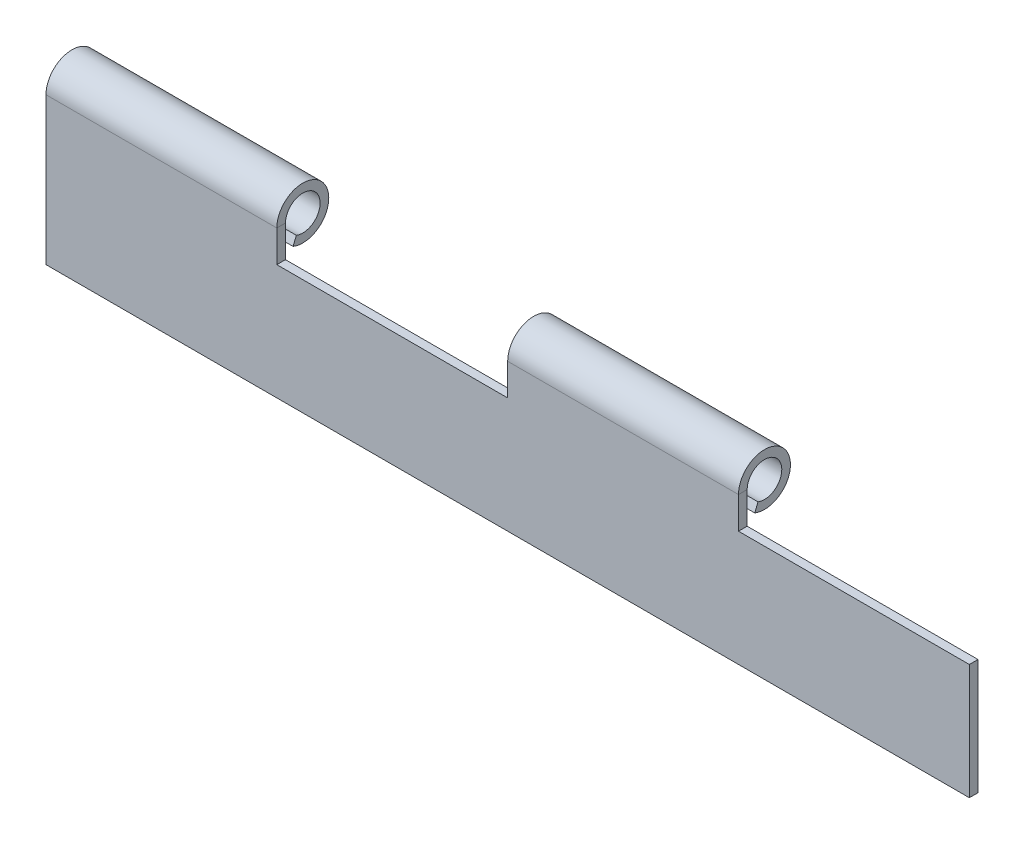
ISO-10303-21;
HEADER;
FILE_DESCRIPTION(('STEP AP214'),'2;1');
FILE_NAME('part.step','',(''),(''),'','','');
FILE_SCHEMA(('AUTOMOTIVE_DESIGN { 1 0 10303 214 1 1 1 1 }'));
ENDSEC;
DATA;
#1=APPLICATION_CONTEXT('core data for automotive mechanical design processes');
#2=APPLICATION_PROTOCOL_DEFINITION('international standard','automotive_design',2000,#1);
#3=PRODUCT_CONTEXT('',#1,'mechanical');
#4=PRODUCT('Part','Part','',(#3));
#5=PRODUCT_RELATED_PRODUCT_CATEGORY('part','',(#4));
#6=PRODUCT_DEFINITION_FORMATION('','',#4);
#7=PRODUCT_DEFINITION_CONTEXT('part definition',#1,'design');
#8=PRODUCT_DEFINITION('design','',#6,#7);
#9=PRODUCT_DEFINITION_SHAPE('','',#8);
#10=(LENGTH_UNIT() NAMED_UNIT(*) SI_UNIT(.MILLI.,.METRE.));
#11=(NAMED_UNIT(*) PLANE_ANGLE_UNIT() SI_UNIT($,.RADIAN.));
#12=(NAMED_UNIT(*) SI_UNIT($,.STERADIAN.) SOLID_ANGLE_UNIT());
#13=UNCERTAINTY_MEASURE_WITH_UNIT(LENGTH_MEASURE(1.E-05),#10,'distance_accuracy_value','');
#14=(GEOMETRIC_REPRESENTATION_CONTEXT(3) GLOBAL_UNCERTAINTY_ASSIGNED_CONTEXT((#13)) GLOBAL_UNIT_ASSIGNED_CONTEXT((#10,
#11,#12)) REPRESENTATION_CONTEXT('',''));
#15=CARTESIAN_POINT('',(0.,0.,0.));
#16=DIRECTION('',(0.,0.,1.));
#17=DIRECTION('',(1.,0.,0.));
#18=AXIS2_PLACEMENT_3D('',#15,#16,#17);
#19=CARTESIAN_POINT('',(80.,20.,1.5));
#20=DIRECTION('',(-1.,0.,0.));
#21=DIRECTION('',(0.,0.,-1.));
#22=AXIS2_PLACEMENT_3D('',#19,#20,#21);
#23=PLANE('',#22);
#24=DIRECTION('',(0.,-1.,0.));
#25=VECTOR('',#24,1.);
#26=CARTESIAN_POINT('',(80.,20.,0.));
#27=LINE('',#26,#25);
#28=CARTESIAN_POINT('',(80.,25.5,0.));
#29=VERTEX_POINT('',#28);
#30=CARTESIAN_POINT('',(80.,20.,0.));
#31=VERTEX_POINT('',#30);
#32=EDGE_CURVE('E246',#29,#31,#27,.T.);
#33=ORIENTED_EDGE('',*,*,#32,.T.);
#34=DIRECTION('',(0.,0.,-1.));
#35=VECTOR('',#34,1.);
#36=CARTESIAN_POINT('',(80.,20.,1.5));
#37=LINE('',#36,#35);
#38=CARTESIAN_POINT('',(80.,20.,1.5));
#39=VERTEX_POINT('',#38);
#40=EDGE_CURVE('E258',#39,#31,#37,.T.);
#41=ORIENTED_EDGE('',*,*,#40,.F.);
#42=DIRECTION('',(0.,-1.,0.));
#43=VECTOR('',#42,1.);
#44=CARTESIAN_POINT('',(80.,20.,1.5));
#45=LINE('',#44,#43);
#46=CARTESIAN_POINT('',(80.,25.5,1.5));
#47=VERTEX_POINT('',#46);
#48=EDGE_CURVE('E176',#47,#39,#45,.T.);
#49=ORIENTED_EDGE('',*,*,#48,.F.);
#50=DIRECTION('',(0.,0.,1.));
#51=VECTOR('',#50,1.);
#52=CARTESIAN_POINT('',(80.,25.5,0.));
#53=LINE('',#52,#51);
#54=EDGE_CURVE('E158',#29,#47,#53,.T.);
#55=ORIENTED_EDGE('',*,*,#54,.F.);
#56=EDGE_LOOP('',(#33,#41,#49,#55));
#57=FACE_BOUND('',#56,.T.);
#58=ADVANCED_FACE('F43',(#57),#23,.T.);
#59=CARTESIAN_POINT('',(0.,0.,1.5));
#60=DIRECTION('',(-1.,0.,0.));
#61=DIRECTION('',(0.,0.,-1.));
#62=AXIS2_PLACEMENT_3D('',#59,#60,#61);
#63=PLANE('',#62);
#64=DIRECTION('',(0.,-1.,0.));
#65=VECTOR('',#64,1.);
#66=CARTESIAN_POINT('',(0.,0.,0.));
#67=LINE('',#66,#65);
#68=CARTESIAN_POINT('',(0.,25.5,0.));
#69=VERTEX_POINT('',#68);
#70=CARTESIAN_POINT('',(0.,0.,0.));
#71=VERTEX_POINT('',#70);
#72=EDGE_CURVE('E227',#69,#71,#67,.T.);
#73=ORIENTED_EDGE('',*,*,#72,.T.);
#74=DIRECTION('',(0.,0.,-1.));
#75=VECTOR('',#74,1.);
#76=CARTESIAN_POINT('',(0.,0.,1.5));
#77=LINE('',#76,#75);
#78=CARTESIAN_POINT('',(0.,0.,1.5));
#79=VERTEX_POINT('',#78);
#80=EDGE_CURVE('E11',#79,#71,#77,.T.);
#81=ORIENTED_EDGE('',*,*,#80,.F.);
#82=DIRECTION('',(0.,-1.,0.));
#83=VECTOR('',#82,1.);
#84=CARTESIAN_POINT('',(0.,0.,1.5));
#85=LINE('',#84,#83);
#86=CARTESIAN_POINT('',(0.,25.5,1.5));
#87=VERTEX_POINT('',#86);
#88=EDGE_CURVE('E236',#87,#79,#85,.T.);
#89=ORIENTED_EDGE('',*,*,#88,.F.);
#90=DIRECTION('',(0.,0.,1.));
#91=VECTOR('',#90,1.);
#92=CARTESIAN_POINT('',(0.,25.5,0.));
#93=LINE('',#92,#91);
#94=EDGE_CURVE('E199',#69,#87,#93,.T.);
#95=ORIENTED_EDGE('',*,*,#94,.F.);
#96=EDGE_LOOP('',(#73,#81,#89,#95));
#97=FACE_BOUND('',#96,.T.);
#98=ADVANCED_FACE('F287',(#97),#63,.T.);
#99=CARTESIAN_POINT('',(160.,0.,1.5));
#100=DIRECTION('',(0.,-1.,0.));
#101=DIRECTION('',(1.,0.,0.));
#102=AXIS2_PLACEMENT_3D('',#99,#100,#101);
#103=PLANE('',#102);
#104=DIRECTION('',(1.,0.,0.));
#105=VECTOR('',#104,1.);
#106=CARTESIAN_POINT('',(160.,0.,0.));
#107=LINE('',#106,#105);
#108=CARTESIAN_POINT('',(160.,0.,0.));
#109=VERTEX_POINT('',#108);
#110=EDGE_CURVE('E221',#71,#109,#107,.T.);
#111=ORIENTED_EDGE('',*,*,#110,.T.);
#112=DIRECTION('',(0.,0.,-1.));
#113=VECTOR('',#112,1.);
#114=CARTESIAN_POINT('',(160.,0.,1.5));
#115=LINE('',#114,#113);
#116=CARTESIAN_POINT('',(160.,0.,1.5));
#117=VERTEX_POINT('',#116);
#118=EDGE_CURVE('E47',#117,#109,#115,.T.);
#119=ORIENTED_EDGE('',*,*,#118,.F.);
#120=DIRECTION('',(1.,0.,0.));
#121=VECTOR('',#120,1.);
#122=CARTESIAN_POINT('',(160.,0.,1.5));
#123=LINE('',#122,#121);
#124=EDGE_CURVE('E223',#79,#117,#123,.T.);
#125=ORIENTED_EDGE('',*,*,#124,.F.);
#126=ORIENTED_EDGE('',*,*,#80,.T.);
#127=EDGE_LOOP('',(#111,#119,#125,#126));
#128=FACE_BOUND('',#127,.T.);
#129=ADVANCED_FACE('F45',(#128),#103,.T.);
#130=CARTESIAN_POINT('',(40.,30.,1.5));
#131=DIRECTION('',(1.,0.,0.));
#132=DIRECTION('',(0.,0.,1.));
#133=AXIS2_PLACEMENT_3D('',#130,#131,#132);
#134=PLANE('',#133);
#135=DIRECTION('',(0.,0.,1.));
#136=VECTOR('',#135,1.);
#137=CARTESIAN_POINT('',(40.,25.5,0.));
#138=LINE('',#137,#136);
#139=CARTESIAN_POINT('',(40.,25.5,0.));
#140=VERTEX_POINT('',#139);
#141=CARTESIAN_POINT('',(40.,25.5,1.5));
#142=VERTEX_POINT('',#141);
#143=EDGE_CURVE('E212',#140,#142,#138,.T.);
#144=ORIENTED_EDGE('',*,*,#143,.T.);
#145=DIRECTION('',(0.,1.,0.));
#146=VECTOR('',#145,1.);
#147=CARTESIAN_POINT('',(40.,30.,1.5));
#148=LINE('',#147,#146);
#149=CARTESIAN_POINT('',(40.,20.,1.5));
#150=VERTEX_POINT('',#149);
#151=EDGE_CURVE('E233',#150,#142,#148,.T.);
#152=ORIENTED_EDGE('',*,*,#151,.F.);
#153=DIRECTION('',(0.,0.,-1.));
#154=VECTOR('',#153,1.);
#155=CARTESIAN_POINT('',(40.,20.,1.5));
#156=LINE('',#155,#154);
#157=CARTESIAN_POINT('',(40.,20.,0.));
#158=VERTEX_POINT('',#157);
#159=EDGE_CURVE('E52',#150,#158,#156,.T.);
#160=ORIENTED_EDGE('',*,*,#159,.T.);
#161=DIRECTION('',(0.,1.,0.));
#162=VECTOR('',#161,1.);
#163=CARTESIAN_POINT('',(40.,30.,0.));
#164=LINE('',#163,#162);
#165=EDGE_CURVE('E251',#158,#140,#164,.T.);
#166=ORIENTED_EDGE('',*,*,#165,.T.);
#167=EDGE_LOOP('',(#144,#152,#160,#166));
#168=FACE_BOUND('',#167,.T.);
#169=ADVANCED_FACE('F298',(#168),#134,.T.);
#170=CARTESIAN_POINT('',(40.,20.,1.5));
#171=DIRECTION('',(0.,1.,0.));
#172=DIRECTION('',(-1.,0.,0.));
#173=AXIS2_PLACEMENT_3D('',#170,#171,#172);
#174=PLANE('',#173);
#175=DIRECTION('',(-1.,0.,0.));
#176=VECTOR('',#175,1.);
#177=CARTESIAN_POINT('',(40.,20.,0.));
#178=LINE('',#177,#176);
#179=EDGE_CURVE('E249',#31,#158,#178,.T.);
#180=ORIENTED_EDGE('',*,*,#179,.T.);
#181=ORIENTED_EDGE('',*,*,#159,.F.);
#182=DIRECTION('',(-1.,0.,0.));
#183=VECTOR('',#182,1.);
#184=CARTESIAN_POINT('',(40.,20.,1.5));
#185=LINE('',#184,#183);
#186=EDGE_CURVE('E231',#39,#150,#185,.T.);
#187=ORIENTED_EDGE('',*,*,#186,.F.);
#188=ORIENTED_EDGE('',*,*,#40,.T.);
#189=EDGE_LOOP('',(#180,#181,#187,#188));
#190=FACE_BOUND('',#189,.T.);
#191=ADVANCED_FACE('F284',(#190),#174,.T.);
#192=CARTESIAN_POINT('',(120.,30.,1.5));
#193=DIRECTION('',(1.,0.,0.));
#194=DIRECTION('',(0.,0.,1.));
#195=AXIS2_PLACEMENT_3D('',#192,#193,#194);
#196=PLANE('',#195);
#197=DIRECTION('',(0.,0.,1.));
#198=VECTOR('',#197,1.);
#199=CARTESIAN_POINT('',(120.,25.5,0.));
#200=LINE('',#199,#198);
#201=CARTESIAN_POINT('',(120.,25.5,0.));
#202=VERTEX_POINT('',#201);
#203=CARTESIAN_POINT('',(120.,25.5,1.5));
#204=VERTEX_POINT('',#203);
#205=EDGE_CURVE('E152',#202,#204,#200,.T.);
#206=ORIENTED_EDGE('',*,*,#205,.T.);
#207=DIRECTION('',(0.,1.,0.));
#208=VECTOR('',#207,1.);
#209=CARTESIAN_POINT('',(120.,30.,1.5));
#210=LINE('',#209,#208);
#211=CARTESIAN_POINT('',(120.,20.,1.5));
#212=VERTEX_POINT('',#211);
#213=EDGE_CURVE('E169',#212,#204,#210,.T.);
#214=ORIENTED_EDGE('',*,*,#213,.F.);
#215=DIRECTION('',(0.,0.,-1.));
#216=VECTOR('',#215,1.);
#217=CARTESIAN_POINT('',(120.,20.,1.5));
#218=LINE('',#217,#216);
#219=CARTESIAN_POINT('',(120.,20.,0.));
#220=VERTEX_POINT('',#219);
#221=EDGE_CURVE('E261',#212,#220,#218,.T.);
#222=ORIENTED_EDGE('',*,*,#221,.T.);
#223=DIRECTION('',(0.,1.,0.));
#224=VECTOR('',#223,1.);
#225=CARTESIAN_POINT('',(120.,30.,0.));
#226=LINE('',#225,#224);
#227=EDGE_CURVE('E181',#220,#202,#226,.T.);
#228=ORIENTED_EDGE('',*,*,#227,.T.);
#229=EDGE_LOOP('',(#206,#214,#222,#228));
#230=FACE_BOUND('',#229,.T.);
#231=ADVANCED_FACE('F179',(#230),#196,.T.);
#232=CARTESIAN_POINT('',(120.,20.,1.5));
#233=DIRECTION('',(0.,1.,0.));
#234=DIRECTION('',(0.,0.,-1.));
#235=AXIS2_PLACEMENT_3D('',#232,#233,#234);
#236=PLANE('',#235);
#237=DIRECTION('',(-1.,0.,0.));
#238=VECTOR('',#237,1.);
#239=CARTESIAN_POINT('',(120.,20.,0.));
#240=LINE('',#239,#238);
#241=CARTESIAN_POINT('',(160.,20.,0.));
#242=VERTEX_POINT('',#241);
#243=EDGE_CURVE('E243',#242,#220,#240,.T.);
#244=ORIENTED_EDGE('',*,*,#243,.T.);
#245=ORIENTED_EDGE('',*,*,#221,.F.);
#246=DIRECTION('',(-1.,0.,0.));
#247=VECTOR('',#246,1.);
#248=CARTESIAN_POINT('',(120.,20.,1.5));
#249=LINE('',#248,#247);
#250=CARTESIAN_POINT('',(160.,20.,1.5));
#251=VERTEX_POINT('',#250);
#252=EDGE_CURVE('E172',#251,#212,#249,.T.);
#253=ORIENTED_EDGE('',*,*,#252,.F.);
#254=DIRECTION('',(0.,0.,-1.));
#255=VECTOR('',#254,1.);
#256=CARTESIAN_POINT('',(160.,20.,1.5));
#257=LINE('',#256,#255);
#258=EDGE_CURVE('E262',#251,#242,#257,.T.);
#259=ORIENTED_EDGE('',*,*,#258,.T.);
#260=EDGE_LOOP('',(#244,#245,#253,#259));
#261=FACE_BOUND('',#260,.T.);
#262=ADVANCED_FACE('F277',(#261),#236,.T.);
#263=CARTESIAN_POINT('',(160.,20.,1.5));
#264=DIRECTION('',(1.,0.,0.));
#265=DIRECTION('',(0.,0.,1.));
#266=AXIS2_PLACEMENT_3D('',#263,#264,#265);
#267=PLANE('',#266);
#268=DIRECTION('',(0.,1.,0.));
#269=VECTOR('',#268,1.);
#270=CARTESIAN_POINT('',(160.,20.,0.));
#271=LINE('',#270,#269);
#272=EDGE_CURVE('E241',#109,#242,#271,.T.);
#273=ORIENTED_EDGE('',*,*,#272,.T.);
#274=ORIENTED_EDGE('',*,*,#258,.F.);
#275=DIRECTION('',(0.,1.,0.));
#276=VECTOR('',#275,1.);
#277=CARTESIAN_POINT('',(160.,20.,1.5));
#278=LINE('',#277,#276);
#279=EDGE_CURVE('E226',#117,#251,#278,.T.);
#280=ORIENTED_EDGE('',*,*,#279,.F.);
#281=ORIENTED_EDGE('',*,*,#118,.T.);
#282=EDGE_LOOP('',(#273,#274,#280,#281));
#283=FACE_BOUND('',#282,.T.);
#284=ADVANCED_FACE('F270',(#283),#267,.T.);
#285=CARTESIAN_POINT('',(0.,0.,1.5));
#286=DIRECTION('',(0.,0.,1.));
#287=DIRECTION('',(-1.,0.,0.));
#288=AXIS2_PLACEMENT_3D('',#285,#286,#287);
#289=PLANE('',#288);
#290=DIRECTION('',(-1.,0.,0.));
#291=VECTOR('',#290,1.);
#292=CARTESIAN_POINT('',(80.,25.5,1.5));
#293=LINE('',#292,#291);
#294=EDGE_CURVE('E159',#47,#204,#293,.F.);
#295=ORIENTED_EDGE('',*,*,#294,.F.);
#296=ORIENTED_EDGE('',*,*,#48,.T.);
#297=ORIENTED_EDGE('',*,*,#186,.T.);
#298=ORIENTED_EDGE('',*,*,#151,.T.);
#299=DIRECTION('',(-1.,0.,0.));
#300=VECTOR('',#299,1.);
#301=CARTESIAN_POINT('',(0.,25.5,1.5));
#302=LINE('',#301,#300);
#303=EDGE_CURVE('E193',#87,#142,#302,.F.);
#304=ORIENTED_EDGE('',*,*,#303,.F.);
#305=ORIENTED_EDGE('',*,*,#88,.T.);
#306=ORIENTED_EDGE('',*,*,#124,.T.);
#307=ORIENTED_EDGE('',*,*,#279,.T.);
#308=ORIENTED_EDGE('',*,*,#252,.T.);
#309=ORIENTED_EDGE('',*,*,#213,.T.);
#310=EDGE_LOOP('',(#295,#296,#297,#298,#304,#305,#306,#307,#308,#309));
#311=FACE_BOUND('',#310,.T.);
#312=ADVANCED_FACE('F170',(#311),#289,.T.);
#313=CARTESIAN_POINT('',(0.,0.,0.));
#314=DIRECTION('',(0.,0.,1.));
#315=DIRECTION('',(-1.,0.,0.));
#316=AXIS2_PLACEMENT_3D('',#313,#314,#315);
#317=PLANE('',#316);
#318=ORIENTED_EDGE('',*,*,#227,.F.);
#319=ORIENTED_EDGE('',*,*,#243,.F.);
#320=ORIENTED_EDGE('',*,*,#272,.F.);
#321=ORIENTED_EDGE('',*,*,#110,.F.);
#322=ORIENTED_EDGE('',*,*,#72,.F.);
#323=DIRECTION('',(-1.,0.,0.));
#324=VECTOR('',#323,1.);
#325=CARTESIAN_POINT('',(0.,25.5,0.));
#326=LINE('',#325,#324);
#327=EDGE_CURVE('E206',#69,#140,#326,.F.);
#328=ORIENTED_EDGE('',*,*,#327,.T.);
#329=ORIENTED_EDGE('',*,*,#165,.F.);
#330=ORIENTED_EDGE('',*,*,#179,.F.);
#331=ORIENTED_EDGE('',*,*,#32,.F.);
#332=DIRECTION('',(-1.,0.,0.));
#333=VECTOR('',#332,1.);
#334=CARTESIAN_POINT('',(80.,25.5,0.));
#335=LINE('',#334,#333);
#336=EDGE_CURVE('E497',#29,#202,#335,.F.);
#337=ORIENTED_EDGE('',*,*,#336,.T.);
#338=EDGE_LOOP('',(#318,#319,#320,#321,#322,#328,#329,#330,#331,#337));
#339=FACE_BOUND('',#338,.T.);
#340=ADVANCED_FACE('F275',(#339),#317,.F.);
#341=CARTESIAN_POINT('',(20.,22.7184484362996,-1.87618021975223));
#342=DIRECTION('',(0.,-0.374606593415923,-0.927183854566783));
#343=DIRECTION('',(-1.,0.,0.));
#344=AXIS2_PLACEMENT_3D('',#341,#342,#343);
#345=PLANE('',#344);
#346=DIRECTION('',(0.,-0.927183854566783,0.374606593415923));
#347=VECTOR('',#346,1.);
#348=CARTESIAN_POINT('',(0.,22.7184484362996,-1.87618021975223));
#349=LINE('',#348,#347);
#350=CARTESIAN_POINT('',(0.,22.7184484362996,-1.87618021975223));
#351=VERTEX_POINT('',#350);
#352=CARTESIAN_POINT('',(0.,21.3276726544495,-1.31427032962835));
#353=VERTEX_POINT('',#352);
#354=EDGE_CURVE('E218',#351,#353,#349,.T.);
#355=ORIENTED_EDGE('',*,*,#354,.T.);
#356=DIRECTION('',(-1.,0.,0.));
#357=VECTOR('',#356,1.);
#358=CARTESIAN_POINT('',(0.,21.3276726544495,-1.31427032962835));
#359=LINE('',#358,#357);
#360=CARTESIAN_POINT('',(40.,21.3276726544495,-1.31427032962835));
#361=VERTEX_POINT('',#360);
#362=EDGE_CURVE('E200',#361,#353,#359,.T.);
#363=ORIENTED_EDGE('',*,*,#362,.F.);
#364=DIRECTION('',(0.,-0.927183854566783,0.374606593415923));
#365=VECTOR('',#364,1.);
#366=CARTESIAN_POINT('',(40.,22.7184484362996,-1.87618021975223));
#367=LINE('',#366,#365);
#368=CARTESIAN_POINT('',(40.,22.7184484362996,-1.87618021975223));
#369=VERTEX_POINT('',#368);
#370=EDGE_CURVE('E215',#369,#361,#367,.T.);
#371=ORIENTED_EDGE('',*,*,#370,.F.);
#372=DIRECTION('',(-1.,0.,0.));
#373=VECTOR('',#372,1.);
#374=CARTESIAN_POINT('',(0.,22.7184484362996,-1.87618021975223));
#375=LINE('',#374,#373);
#376=EDGE_CURVE('E191',#369,#351,#375,.T.);
#377=ORIENTED_EDGE('',*,*,#376,.T.);
#378=EDGE_LOOP('',(#355,#363,#371,#377));
#379=FACE_BOUND('',#378,.T.);
#380=ADVANCED_FACE('F305',(#379),#345,.F.);
#381=CARTESIAN_POINT('',(40.,25.5,-3.));
#382=DIRECTION('',(1.,0.,0.));
#383=DIRECTION('',(0.,0.,1.));
#384=AXIS2_PLACEMENT_3D('',#381,#382,#383);
#385=PLANE('',#384);
#386=ORIENTED_EDGE('',*,*,#370,.T.);
#387=CARTESIAN_POINT('',(40.,25.5,-3.));
#388=DIRECTION('',(1.,0.,0.));
#389=DIRECTION('',(0.,0.,-1.));
#390=AXIS2_PLACEMENT_3D('',#387,#388,#389);
#391=CIRCLE('',#390,4.5);
#392=EDGE_CURVE('E196',#142,#361,#391,.F.);
#393=ORIENTED_EDGE('',*,*,#392,.F.);
#394=ORIENTED_EDGE('',*,*,#143,.F.);
#395=CARTESIAN_POINT('',(40.,25.5,-3.));
#396=DIRECTION('',(1.,0.,0.));
#397=DIRECTION('',(0.,0.,-1.));
#398=AXIS2_PLACEMENT_3D('',#395,#396,#397);
#399=CIRCLE('',#398,3.);
#400=EDGE_CURVE('E203',#140,#369,#399,.F.);
#401=ORIENTED_EDGE('',*,*,#400,.T.);
#402=EDGE_LOOP('',(#386,#393,#394,#401));
#403=FACE_BOUND('',#402,.T.);
#404=ADVANCED_FACE('F312',(#403),#385,.T.);
#405=CARTESIAN_POINT('',(0.,25.5,-3.));
#406=DIRECTION('',(1.,0.,0.));
#407=DIRECTION('',(0.,0.,1.));
#408=AXIS2_PLACEMENT_3D('',#405,#406,#407);
#409=PLANE('',#408);
#410=CARTESIAN_POINT('',(0.,25.5,-3.));
#411=DIRECTION('',(1.,0.,0.));
#412=DIRECTION('',(0.,0.,-1.));
#413=AXIS2_PLACEMENT_3D('',#410,#411,#412);
#414=CIRCLE('',#413,3.);
#415=EDGE_CURVE('E68',#351,#69,#414,.T.);
#416=ORIENTED_EDGE('',*,*,#415,.T.);
#417=ORIENTED_EDGE('',*,*,#94,.T.);
#418=CARTESIAN_POINT('',(0.,25.5,-3.));
#419=DIRECTION('',(1.,0.,0.));
#420=DIRECTION('',(0.,0.,-1.));
#421=AXIS2_PLACEMENT_3D('',#418,#419,#420);
#422=CIRCLE('',#421,4.5);
#423=EDGE_CURVE('E197',#353,#87,#422,.T.);
#424=ORIENTED_EDGE('',*,*,#423,.F.);
#425=ORIENTED_EDGE('',*,*,#354,.F.);
#426=EDGE_LOOP('',(#416,#417,#424,#425));
#427=FACE_BOUND('',#426,.T.);
#428=ADVANCED_FACE('F308',(#427),#409,.F.);
#429=CARTESIAN_POINT('',(0.,25.5,-3.));
#430=DIRECTION('',(-1.,0.,0.));
#431=DIRECTION('',(0.,-0.927183854566783,0.374606593415923));
#432=AXIS2_PLACEMENT_3D('',#429,#430,#431);
#433=CYLINDRICAL_SURFACE('',#432,4.5);
#434=ORIENTED_EDGE('',*,*,#303,.T.);
#435=ORIENTED_EDGE('',*,*,#392,.T.);
#436=ORIENTED_EDGE('',*,*,#362,.T.);
#437=ORIENTED_EDGE('',*,*,#423,.T.);
#438=EDGE_LOOP('',(#434,#435,#436,#437));
#439=FACE_BOUND('',#438,.T.);
#440=ADVANCED_FACE('F311',(#439),#433,.T.);
#441=CARTESIAN_POINT('',(0.,25.5,-3.));
#442=DIRECTION('',(-1.,0.,0.));
#443=DIRECTION('',(0.,-0.927183854566783,0.374606593415923));
#444=AXIS2_PLACEMENT_3D('',#441,#442,#443);
#445=CYLINDRICAL_SURFACE('',#444,3.);
#446=ORIENTED_EDGE('',*,*,#327,.F.);
#447=ORIENTED_EDGE('',*,*,#415,.F.);
#448=ORIENTED_EDGE('',*,*,#376,.F.);
#449=ORIENTED_EDGE('',*,*,#400,.F.);
#450=EDGE_LOOP('',(#446,#447,#448,#449));
#451=FACE_BOUND('',#450,.T.);
#452=ADVANCED_FACE('F319',(#451),#445,.F.);
#453=CARTESIAN_POINT('',(100.,22.7184484362996,-1.87618021975223));
#454=DIRECTION('',(0.,-0.374606593415923,-0.927183854566783));
#455=DIRECTION('',(-1.,0.,0.));
#456=AXIS2_PLACEMENT_3D('',#453,#454,#455);
#457=PLANE('',#456);
#458=DIRECTION('',(0.,-0.927183854566783,0.374606593415923));
#459=VECTOR('',#458,1.);
#460=CARTESIAN_POINT('',(80.,22.7184484362996,-1.87618021975223));
#461=LINE('',#460,#459);
#462=CARTESIAN_POINT('',(80.,22.7184484362996,-1.87618021975223));
#463=VERTEX_POINT('',#462);
#464=CARTESIAN_POINT('',(80.,21.3276726544495,-1.31427032962835));
#465=VERTEX_POINT('',#464);
#466=EDGE_CURVE('E183',#463,#465,#461,.T.);
#467=ORIENTED_EDGE('',*,*,#466,.T.);
#468=DIRECTION('',(-1.,0.,0.));
#469=VECTOR('',#468,1.);
#470=CARTESIAN_POINT('',(80.,21.3276726544495,-1.31427032962835));
#471=LINE('',#470,#469);
#472=CARTESIAN_POINT('',(120.,21.3276726544495,-1.31427032962835));
#473=VERTEX_POINT('',#472);
#474=EDGE_CURVE('E516',#473,#465,#471,.T.);
#475=ORIENTED_EDGE('',*,*,#474,.F.);
#476=DIRECTION('',(0.,-0.927183854566783,0.374606593415923));
#477=VECTOR('',#476,1.);
#478=CARTESIAN_POINT('',(120.,22.7184484362996,-1.87618021975223));
#479=LINE('',#478,#477);
#480=CARTESIAN_POINT('',(120.,22.7184484362996,-1.87618021975223));
#481=VERTEX_POINT('',#480);
#482=EDGE_CURVE('E154',#481,#473,#479,.T.);
#483=ORIENTED_EDGE('',*,*,#482,.F.);
#484=DIRECTION('',(-1.,0.,0.));
#485=VECTOR('',#484,1.);
#486=CARTESIAN_POINT('',(80.,22.7184484362996,-1.87618021975223));
#487=LINE('',#486,#485);
#488=EDGE_CURVE('E187',#481,#463,#487,.T.);
#489=ORIENTED_EDGE('',*,*,#488,.T.);
#490=EDGE_LOOP('',(#467,#475,#483,#489));
#491=FACE_BOUND('',#490,.T.);
#492=ADVANCED_FACE('F322',(#491),#457,.F.);
#493=CARTESIAN_POINT('',(120.,25.5,-3.));
#494=DIRECTION('',(1.,0.,0.));
#495=DIRECTION('',(0.,0.,1.));
#496=AXIS2_PLACEMENT_3D('',#493,#494,#495);
#497=PLANE('',#496);
#498=ORIENTED_EDGE('',*,*,#482,.T.);
#499=CARTESIAN_POINT('',(120.,25.5,-3.));
#500=DIRECTION('',(1.,0.,0.));
#501=DIRECTION('',(0.,0.,-1.));
#502=AXIS2_PLACEMENT_3D('',#499,#500,#501);
#503=CIRCLE('',#502,4.5);
#504=EDGE_CURVE('E148',#204,#473,#503,.F.);
#505=ORIENTED_EDGE('',*,*,#504,.F.);
#506=ORIENTED_EDGE('',*,*,#205,.F.);
#507=CARTESIAN_POINT('',(120.,25.5,-3.));
#508=DIRECTION('',(1.,0.,0.));
#509=DIRECTION('',(0.,0.,-1.));
#510=AXIS2_PLACEMENT_3D('',#507,#508,#509);
#511=CIRCLE('',#510,3.);
#512=EDGE_CURVE('E501',#202,#481,#511,.F.);
#513=ORIENTED_EDGE('',*,*,#512,.T.);
#514=EDGE_LOOP('',(#498,#505,#506,#513));
#515=FACE_BOUND('',#514,.T.);
#516=ADVANCED_FACE('F150',(#515),#497,.T.);
#517=CARTESIAN_POINT('',(80.,25.5,-3.));
#518=DIRECTION('',(1.,0.,0.));
#519=DIRECTION('',(0.,0.,1.));
#520=AXIS2_PLACEMENT_3D('',#517,#518,#519);
#521=PLANE('',#520);
#522=CARTESIAN_POINT('',(80.,25.5,-3.));
#523=DIRECTION('',(1.,0.,0.));
#524=DIRECTION('',(0.,0.,-1.));
#525=AXIS2_PLACEMENT_3D('',#522,#523,#524);
#526=CIRCLE('',#525,3.);
#527=EDGE_CURVE('E60',#463,#29,#526,.T.);
#528=ORIENTED_EDGE('',*,*,#527,.T.);
#529=ORIENTED_EDGE('',*,*,#54,.T.);
#530=CARTESIAN_POINT('',(80.,25.5,-3.));
#531=DIRECTION('',(1.,0.,0.));
#532=DIRECTION('',(0.,0.,-1.));
#533=AXIS2_PLACEMENT_3D('',#530,#531,#532);
#534=CIRCLE('',#533,4.5);
#535=EDGE_CURVE('E164',#465,#47,#534,.T.);
#536=ORIENTED_EDGE('',*,*,#535,.F.);
#537=ORIENTED_EDGE('',*,*,#466,.F.);
#538=EDGE_LOOP('',(#528,#529,#536,#537));
#539=FACE_BOUND('',#538,.T.);
#540=ADVANCED_FACE('F327',(#539),#521,.F.);
#541=CARTESIAN_POINT('',(80.,25.5,-3.));
#542=DIRECTION('',(-1.,0.,0.));
#543=DIRECTION('',(0.,-0.927183854566783,0.374606593415923));
#544=AXIS2_PLACEMENT_3D('',#541,#542,#543);
#545=CYLINDRICAL_SURFACE('',#544,4.5);
#546=ORIENTED_EDGE('',*,*,#294,.T.);
#547=ORIENTED_EDGE('',*,*,#504,.T.);
#548=ORIENTED_EDGE('',*,*,#474,.T.);
#549=ORIENTED_EDGE('',*,*,#535,.T.);
#550=EDGE_LOOP('',(#546,#547,#548,#549));
#551=FACE_BOUND('',#550,.T.);
#552=ADVANCED_FACE('F163',(#551),#545,.T.);
#553=CARTESIAN_POINT('',(80.,25.5,-3.));
#554=DIRECTION('',(-1.,0.,0.));
#555=DIRECTION('',(0.,-0.927183854566783,0.374606593415923));
#556=AXIS2_PLACEMENT_3D('',#553,#554,#555);
#557=CYLINDRICAL_SURFACE('',#556,3.);
#558=ORIENTED_EDGE('',*,*,#336,.F.);
#559=ORIENTED_EDGE('',*,*,#527,.F.);
#560=ORIENTED_EDGE('',*,*,#488,.F.);
#561=ORIENTED_EDGE('',*,*,#512,.F.);
#562=EDGE_LOOP('',(#558,#559,#560,#561));
#563=FACE_BOUND('',#562,.T.);
#564=ADVANCED_FACE('F335',(#563),#557,.F.);
#565=CLOSED_SHELL('',(#58,#98,#129,#169,#191,#231,#262,#284,#312,#340,#380,#404,#428,#440,#452,
#492,#516,#540,#552,#564));
#566=MANIFOLD_SOLID_BREP('B2',#565);
#567=ADVANCED_BREP_SHAPE_REPRESENTATION('',(#18,#566),#14);
#568=SHAPE_DEFINITION_REPRESENTATION(#9,#567);
ENDSEC;
END-ISO-10303-21;
